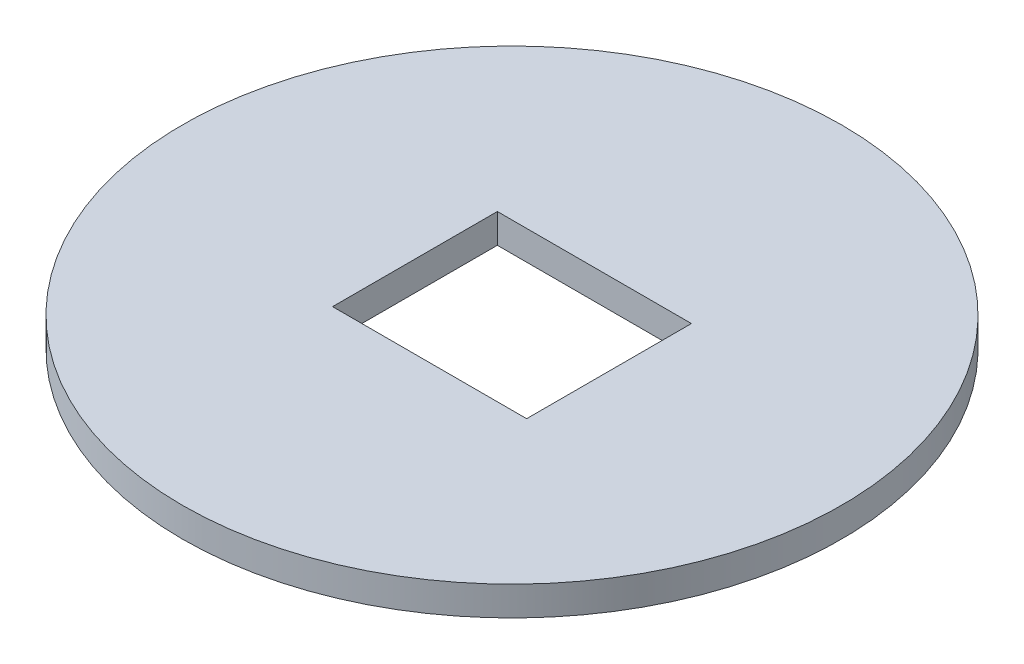
ISO-10303-21;
HEADER;
FILE_DESCRIPTION(('STEP AP214'),'2;1');
FILE_NAME('part.step','',(''),(''),'','','');
FILE_SCHEMA(('AUTOMOTIVE_DESIGN { 1 0 10303 214 1 1 1 1 }'));
ENDSEC;
DATA;
#1=APPLICATION_CONTEXT('core data for automotive mechanical design processes');
#2=APPLICATION_PROTOCOL_DEFINITION('international standard','automotive_design',2000,#1);
#3=PRODUCT_CONTEXT('',#1,'mechanical');
#4=PRODUCT('Part','Part','',(#3));
#5=PRODUCT_RELATED_PRODUCT_CATEGORY('part','',(#4));
#6=PRODUCT_DEFINITION_FORMATION('','',#4);
#7=PRODUCT_DEFINITION_CONTEXT('part definition',#1,'design');
#8=PRODUCT_DEFINITION('design','',#6,#7);
#9=PRODUCT_DEFINITION_SHAPE('','',#8);
#10=(LENGTH_UNIT() NAMED_UNIT(*) SI_UNIT(.MILLI.,.METRE.));
#11=(NAMED_UNIT(*) PLANE_ANGLE_UNIT() SI_UNIT($,.RADIAN.));
#12=(NAMED_UNIT(*) SI_UNIT($,.STERADIAN.) SOLID_ANGLE_UNIT());
#13=UNCERTAINTY_MEASURE_WITH_UNIT(LENGTH_MEASURE(1.E-05),#10,'distance_accuracy_value','');
#14=(GEOMETRIC_REPRESENTATION_CONTEXT(3) GLOBAL_UNCERTAINTY_ASSIGNED_CONTEXT((#13)) GLOBAL_UNIT_ASSIGNED_CONTEXT((#10,
#11,#12)) REPRESENTATION_CONTEXT('',''));
#15=CARTESIAN_POINT('',(0.,0.,0.));
#16=DIRECTION('',(0.,0.,1.));
#17=DIRECTION('',(1.,0.,0.));
#18=AXIS2_PLACEMENT_3D('',#15,#16,#17);
#19=CARTESIAN_POINT('',(0.,8.,0.));
#20=DIRECTION('',(0.,1.,0.));
#21=DIRECTION('',(0.,0.,1.));
#22=AXIS2_PLACEMENT_3D('',#19,#20,#21);
#23=PLANE('',#22);
#24=CARTESIAN_POINT('',(0.,8.,0.));
#25=DIRECTION('',(0.,1.,0.));
#26=DIRECTION('',(0.,0.,1.));
#27=AXIS2_PLACEMENT_3D('',#24,#25,#26);
#28=CIRCLE('',#27,90.);
#29=CARTESIAN_POINT('',(0.,8.,90.));
#30=VERTEX_POINT('',#29);
#31=EDGE_CURVE('E11',#30,#30,#28,.T.);
#32=ORIENTED_EDGE('',*,*,#31,.T.);
#33=EDGE_LOOP('',(#32));
#34=FACE_BOUND('',#33,.T.);
#35=DIRECTION('',(1.,0.,0.));
#36=VECTOR('',#35,1.);
#37=CARTESIAN_POINT('',(-26.5,8.,22.5));
#38=LINE('',#37,#36);
#39=CARTESIAN_POINT('',(-26.5,8.,22.5));
#40=VERTEX_POINT('',#39);
#41=CARTESIAN_POINT('',(26.5,8.,22.5));
#42=VERTEX_POINT('',#41);
#43=EDGE_CURVE('E86',#40,#42,#38,.T.);
#44=ORIENTED_EDGE('',*,*,#43,.F.);
#45=DIRECTION('',(0.,0.,1.));
#46=VECTOR('',#45,1.);
#47=CARTESIAN_POINT('',(-26.5,8.,-22.5));
#48=LINE('',#47,#46);
#49=CARTESIAN_POINT('',(-26.5,8.,-22.5));
#50=VERTEX_POINT('',#49);
#51=EDGE_CURVE('E78',#50,#40,#48,.T.);
#52=ORIENTED_EDGE('',*,*,#51,.F.);
#53=DIRECTION('',(-1.,0.,0.));
#54=VECTOR('',#53,1.);
#55=CARTESIAN_POINT('',(-26.5,8.,-22.5));
#56=LINE('',#55,#54);
#57=CARTESIAN_POINT('',(26.5,8.,-22.5));
#58=VERTEX_POINT('',#57);
#59=EDGE_CURVE('E99',#58,#50,#56,.T.);
#60=ORIENTED_EDGE('',*,*,#59,.F.);
#61=DIRECTION('',(0.,0.,-1.));
#62=VECTOR('',#61,1.);
#63=CARTESIAN_POINT('',(26.5,8.,-22.5));
#64=LINE('',#63,#62);
#65=EDGE_CURVE('E97',#42,#58,#64,.T.);
#66=ORIENTED_EDGE('',*,*,#65,.F.);
#67=EDGE_LOOP('',(#44,#52,#60,#66));
#68=FACE_BOUND('',#67,.T.);
#69=ADVANCED_FACE('F37',(#34,#68),#23,.T.);
#70=CARTESIAN_POINT('',(0.,0.,0.));
#71=DIRECTION('',(0.,1.,0.));
#72=DIRECTION('',(0.,0.,1.));
#73=AXIS2_PLACEMENT_3D('',#70,#71,#72);
#74=PLANE('',#73);
#75=CARTESIAN_POINT('',(0.,0.,0.));
#76=DIRECTION('',(0.,1.,0.));
#77=DIRECTION('',(0.,0.,1.));
#78=AXIS2_PLACEMENT_3D('',#75,#76,#77);
#79=CIRCLE('',#78,90.);
#80=CARTESIAN_POINT('',(0.,0.,90.));
#81=VERTEX_POINT('',#80);
#82=EDGE_CURVE('E41',#81,#81,#79,.T.);
#83=ORIENTED_EDGE('',*,*,#82,.F.);
#84=EDGE_LOOP('',(#83));
#85=FACE_BOUND('',#84,.T.);
#86=DIRECTION('',(0.,0.,1.));
#87=VECTOR('',#86,1.);
#88=CARTESIAN_POINT('',(-26.5,0.,-22.5));
#89=LINE('',#88,#87);
#90=CARTESIAN_POINT('',(-26.5,0.,-22.5));
#91=VERTEX_POINT('',#90);
#92=CARTESIAN_POINT('',(-26.5,0.,22.5));
#93=VERTEX_POINT('',#92);
#94=EDGE_CURVE('E60',#91,#93,#89,.T.);
#95=ORIENTED_EDGE('',*,*,#94,.T.);
#96=DIRECTION('',(1.,0.,0.));
#97=VECTOR('',#96,1.);
#98=CARTESIAN_POINT('',(-26.5,0.,22.5));
#99=LINE('',#98,#97);
#100=CARTESIAN_POINT('',(26.5,0.,22.5));
#101=VERTEX_POINT('',#100);
#102=EDGE_CURVE('E93',#93,#101,#99,.T.);
#103=ORIENTED_EDGE('',*,*,#102,.T.);
#104=DIRECTION('',(0.,0.,-1.));
#105=VECTOR('',#104,1.);
#106=CARTESIAN_POINT('',(26.5,0.,-22.5));
#107=LINE('',#106,#105);
#108=CARTESIAN_POINT('',(26.5,0.,-22.5));
#109=VERTEX_POINT('',#108);
#110=EDGE_CURVE('E105',#101,#109,#107,.T.);
#111=ORIENTED_EDGE('',*,*,#110,.T.);
#112=DIRECTION('',(-1.,0.,0.));
#113=VECTOR('',#112,1.);
#114=CARTESIAN_POINT('',(-26.5,0.,-22.5));
#115=LINE('',#114,#113);
#116=EDGE_CURVE('E87',#109,#91,#115,.T.);
#117=ORIENTED_EDGE('',*,*,#116,.T.);
#118=EDGE_LOOP('',(#95,#103,#111,#117));
#119=FACE_BOUND('',#118,.T.);
#120=ADVANCED_FACE('F116',(#85,#119),#74,.F.);
#121=CARTESIAN_POINT('',(0.,8.,0.));
#122=DIRECTION('',(0.,-1.,0.));
#123=DIRECTION('',(0.,0.,-1.));
#124=AXIS2_PLACEMENT_3D('',#121,#122,#123);
#125=CYLINDRICAL_SURFACE('',#124,90.);
#126=ORIENTED_EDGE('',*,*,#31,.F.);
#127=EDGE_LOOP('',(#126));
#128=FACE_BOUND('',#127,.T.);
#129=ORIENTED_EDGE('',*,*,#82,.T.);
#130=EDGE_LOOP('',(#129));
#131=FACE_BOUND('',#130,.T.);
#132=ADVANCED_FACE('F39',(#128,#131),#125,.T.);
#133=CARTESIAN_POINT('',(-26.5,8.,-22.5));
#134=DIRECTION('',(1.,0.,0.));
#135=DIRECTION('',(0.,0.,-1.));
#136=AXIS2_PLACEMENT_3D('',#133,#134,#135);
#137=PLANE('',#136);
#138=ORIENTED_EDGE('',*,*,#94,.F.);
#139=DIRECTION('',(0.,-1.,0.));
#140=VECTOR('',#139,1.);
#141=CARTESIAN_POINT('',(-26.5,8.,-22.5));
#142=LINE('',#141,#140);
#143=EDGE_CURVE('E82',#50,#91,#142,.T.);
#144=ORIENTED_EDGE('',*,*,#143,.F.);
#145=ORIENTED_EDGE('',*,*,#51,.T.);
#146=DIRECTION('',(0.,-1.,0.));
#147=VECTOR('',#146,1.);
#148=CARTESIAN_POINT('',(-26.5,8.,22.5));
#149=LINE('',#148,#147);
#150=EDGE_CURVE('E81',#40,#93,#149,.T.);
#151=ORIENTED_EDGE('',*,*,#150,.T.);
#152=EDGE_LOOP('',(#138,#144,#145,#151));
#153=FACE_BOUND('',#152,.T.);
#154=ADVANCED_FACE('F80',(#153),#137,.T.);
#155=CARTESIAN_POINT('',(-26.5,8.,22.5));
#156=DIRECTION('',(0.,0.,-1.));
#157=DIRECTION('',(-1.,0.,0.));
#158=AXIS2_PLACEMENT_3D('',#155,#156,#157);
#159=PLANE('',#158);
#160=ORIENTED_EDGE('',*,*,#102,.F.);
#161=ORIENTED_EDGE('',*,*,#150,.F.);
#162=ORIENTED_EDGE('',*,*,#43,.T.);
#163=DIRECTION('',(0.,-1.,0.));
#164=VECTOR('',#163,1.);
#165=CARTESIAN_POINT('',(26.5,8.,22.5));
#166=LINE('',#165,#164);
#167=EDGE_CURVE('E94',#42,#101,#166,.T.);
#168=ORIENTED_EDGE('',*,*,#167,.T.);
#169=EDGE_LOOP('',(#160,#161,#162,#168));
#170=FACE_BOUND('',#169,.T.);
#171=ADVANCED_FACE('F90',(#170),#159,.T.);
#172=CARTESIAN_POINT('',(26.5,8.,-22.5));
#173=DIRECTION('',(-1.,0.,0.));
#174=DIRECTION('',(0.,0.,1.));
#175=AXIS2_PLACEMENT_3D('',#172,#173,#174);
#176=PLANE('',#175);
#177=ORIENTED_EDGE('',*,*,#110,.F.);
#178=ORIENTED_EDGE('',*,*,#167,.F.);
#179=ORIENTED_EDGE('',*,*,#65,.T.);
#180=DIRECTION('',(0.,-1.,0.));
#181=VECTOR('',#180,1.);
#182=CARTESIAN_POINT('',(26.5,8.,-22.5));
#183=LINE('',#182,#181);
#184=EDGE_CURVE('E52',#58,#109,#183,.T.);
#185=ORIENTED_EDGE('',*,*,#184,.T.);
#186=EDGE_LOOP('',(#177,#178,#179,#185));
#187=FACE_BOUND('',#186,.T.);
#188=ADVANCED_FACE('F114',(#187),#176,.T.);
#189=CARTESIAN_POINT('',(-26.5,8.,-22.5));
#190=DIRECTION('',(0.,0.,1.));
#191=DIRECTION('',(1.,0.,0.));
#192=AXIS2_PLACEMENT_3D('',#189,#190,#191);
#193=PLANE('',#192);
#194=ORIENTED_EDGE('',*,*,#116,.F.);
#195=ORIENTED_EDGE('',*,*,#184,.F.);
#196=ORIENTED_EDGE('',*,*,#59,.T.);
#197=ORIENTED_EDGE('',*,*,#143,.T.);
#198=EDGE_LOOP('',(#194,#195,#196,#197));
#199=FACE_BOUND('',#198,.T.);
#200=ADVANCED_FACE('F117',(#199),#193,.T.);
#201=CLOSED_SHELL('',(#69,#120,#132,#154,#171,#188,#200));
#202=MANIFOLD_SOLID_BREP('B2',#201);
#203=ADVANCED_BREP_SHAPE_REPRESENTATION('',(#18,#202),#14);
#204=SHAPE_DEFINITION_REPRESENTATION(#9,#203);
ENDSEC;
END-ISO-10303-21;
